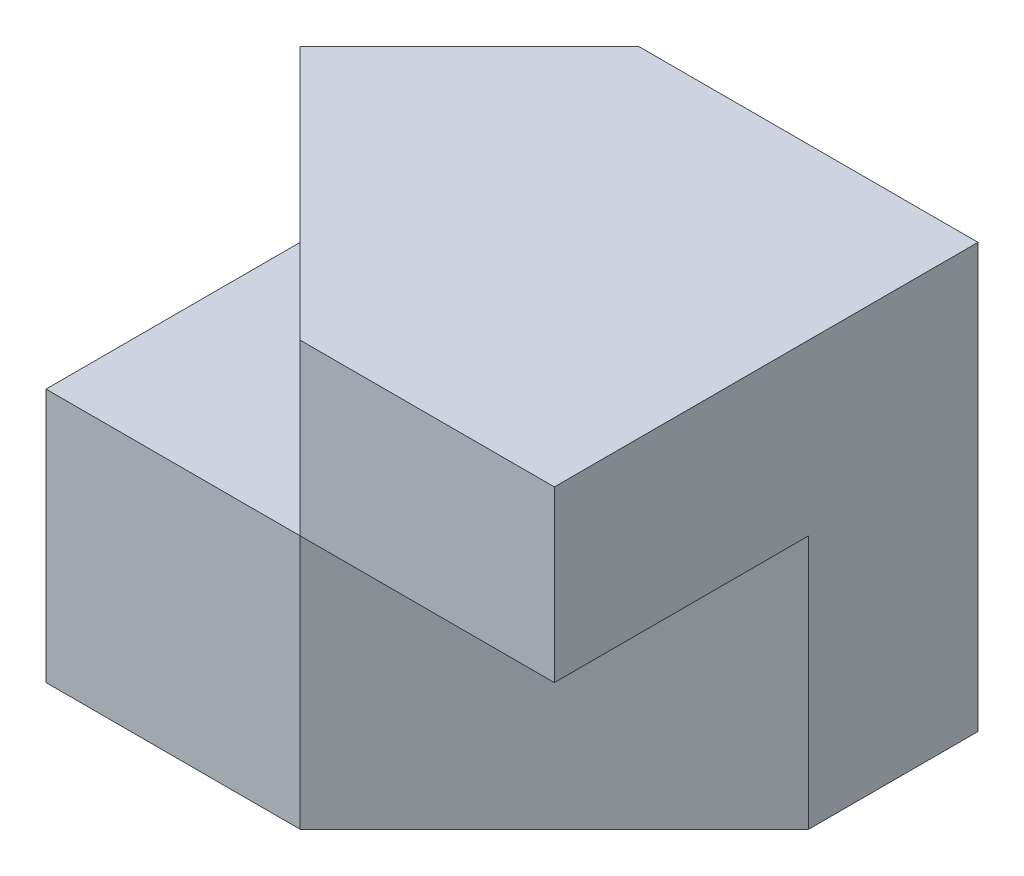
ISO-10303-21;
HEADER;
FILE_DESCRIPTION(('STEP AP214'),'2;1');
FILE_NAME('part.step','',(''),(''),'','','');
FILE_SCHEMA(('AUTOMOTIVE_DESIGN { 1 0 10303 214 1 1 1 1 }'));
ENDSEC;
DATA;
#1=APPLICATION_CONTEXT('core data for automotive mechanical design processes');
#2=APPLICATION_PROTOCOL_DEFINITION('international standard','automotive_design',2000,#1);
#3=PRODUCT_CONTEXT('',#1,'mechanical');
#4=PRODUCT('Part','Part','',(#3));
#5=PRODUCT_RELATED_PRODUCT_CATEGORY('part','',(#4));
#6=PRODUCT_DEFINITION_FORMATION('','',#4);
#7=PRODUCT_DEFINITION_CONTEXT('part definition',#1,'design');
#8=PRODUCT_DEFINITION('design','',#6,#7);
#9=PRODUCT_DEFINITION_SHAPE('','',#8);
#10=(LENGTH_UNIT() NAMED_UNIT(*) SI_UNIT(.MILLI.,.METRE.));
#11=(NAMED_UNIT(*) PLANE_ANGLE_UNIT() SI_UNIT($,.RADIAN.));
#12=(NAMED_UNIT(*) SI_UNIT($,.STERADIAN.) SOLID_ANGLE_UNIT());
#13=UNCERTAINTY_MEASURE_WITH_UNIT(LENGTH_MEASURE(1.E-05),#10,'distance_accuracy_value','');
#14=(GEOMETRIC_REPRESENTATION_CONTEXT(3) GLOBAL_UNCERTAINTY_ASSIGNED_CONTEXT((#13)) GLOBAL_UNIT_ASSIGNED_CONTEXT((#10,
#11,#12)) REPRESENTATION_CONTEXT('',''));
#15=CARTESIAN_POINT('',(0.,0.,0.));
#16=DIRECTION('',(0.,0.,1.));
#17=DIRECTION('',(1.,0.,0.));
#18=AXIS2_PLACEMENT_3D('',#15,#16,#17);
#19=CARTESIAN_POINT('',(0.,0.,5.));
#20=DIRECTION('',(0.,0.,-1.));
#21=DIRECTION('',(-1.,0.,0.));
#22=AXIS2_PLACEMENT_3D('',#19,#20,#21);
#23=PLANE('',#22);
#24=DIRECTION('',(-1.,0.,0.));
#25=VECTOR('',#24,1.);
#26=CARTESIAN_POINT('',(6.,3.,5.));
#27=LINE('',#26,#25);
#28=CARTESIAN_POINT('',(6.,3.,5.));
#29=VERTEX_POINT('',#28);
#30=CARTESIAN_POINT('',(3.,3.,5.));
#31=VERTEX_POINT('',#30);
#32=EDGE_CURVE('E97',#29,#31,#27,.T.);
#33=ORIENTED_EDGE('',*,*,#32,.F.);
#34=DIRECTION('',(0.,1.,0.));
#35=VECTOR('',#34,1.);
#36=CARTESIAN_POINT('',(6.,0.,5.));
#37=LINE('',#36,#35);
#38=CARTESIAN_POINT('',(6.,5.,5.));
#39=VERTEX_POINT('',#38);
#40=EDGE_CURVE('E158',#29,#39,#37,.T.);
#41=ORIENTED_EDGE('',*,*,#40,.T.);
#42=DIRECTION('',(-1.,0.,0.));
#43=VECTOR('',#42,1.);
#44=CARTESIAN_POINT('',(0.,5.,5.));
#45=LINE('',#44,#43);
#46=CARTESIAN_POINT('',(3.,5.,5.));
#47=VERTEX_POINT('',#46);
#48=EDGE_CURVE('E139',#39,#47,#45,.T.);
#49=ORIENTED_EDGE('',*,*,#48,.T.);
#50=DIRECTION('',(0.,1.,0.));
#51=VECTOR('',#50,1.);
#52=CARTESIAN_POINT('',(3.,3.,5.));
#53=LINE('',#52,#51);
#54=EDGE_CURVE('E133',#31,#47,#53,.T.);
#55=ORIENTED_EDGE('',*,*,#54,.F.);
#56=EDGE_LOOP('',(#33,#41,#49,#55));
#57=FACE_BOUND('',#56,.T.);
#58=ADVANCED_FACE('F33',(#57),#23,.F.);
#59=CARTESIAN_POINT('',(0.,0.,5.));
#60=DIRECTION('',(1.,0.,0.));
#61=DIRECTION('',(0.,1.,0.));
#62=AXIS2_PLACEMENT_3D('',#59,#60,#61);
#63=PLANE('',#62);
#64=DIRECTION('',(0.,0.,1.));
#65=VECTOR('',#64,1.);
#66=CARTESIAN_POINT('',(0.,3.,5.));
#67=LINE('',#66,#65);
#68=CARTESIAN_POINT('',(0.,3.,2.));
#69=VERTEX_POINT('',#68);
#70=CARTESIAN_POINT('',(0.,3.,5.));
#71=VERTEX_POINT('',#70);
#72=EDGE_CURVE('E129',#69,#71,#67,.T.);
#73=ORIENTED_EDGE('',*,*,#72,.F.);
#74=DIRECTION('',(0.,1.,0.));
#75=VECTOR('',#74,1.);
#76=CARTESIAN_POINT('',(0.,0.,2.));
#77=LINE('',#76,#75);
#78=CARTESIAN_POINT('',(0.,0.,2.));
#79=VERTEX_POINT('',#78);
#80=EDGE_CURVE('E147',#79,#69,#77,.T.);
#81=ORIENTED_EDGE('',*,*,#80,.F.);
#82=DIRECTION('',(0.,0.,-1.));
#83=VECTOR('',#82,1.);
#84=CARTESIAN_POINT('',(0.,0.,5.));
#85=LINE('',#84,#83);
#86=CARTESIAN_POINT('',(0.,0.,5.));
#87=VERTEX_POINT('',#86);
#88=EDGE_CURVE('E11',#87,#79,#85,.T.);
#89=ORIENTED_EDGE('',*,*,#88,.F.);
#90=DIRECTION('',(0.,-1.,0.));
#91=VECTOR('',#90,1.);
#92=CARTESIAN_POINT('',(0.,0.,5.));
#93=LINE('',#92,#91);
#94=EDGE_CURVE('E154',#71,#87,#93,.T.);
#95=ORIENTED_EDGE('',*,*,#94,.F.);
#96=EDGE_LOOP('',(#73,#81,#89,#95));
#97=FACE_BOUND('',#96,.T.);
#98=ADVANCED_FACE('F35',(#97),#63,.F.);
#99=CARTESIAN_POINT('',(0.,0.,5.));
#100=DIRECTION('',(0.,1.,0.));
#101=DIRECTION('',(0.,0.,1.));
#102=AXIS2_PLACEMENT_3D('',#99,#100,#101);
#103=PLANE('',#102);
#104=DIRECTION('',(0.,0.,-1.));
#105=VECTOR('',#104,1.);
#106=CARTESIAN_POINT('',(6.,0.,5.));
#107=LINE('',#106,#105);
#108=CARTESIAN_POINT('',(6.,0.,2.));
#109=VERTEX_POINT('',#108);
#110=CARTESIAN_POINT('',(6.,0.,0.));
#111=VERTEX_POINT('',#110);
#112=EDGE_CURVE('E41',#109,#111,#107,.T.);
#113=ORIENTED_EDGE('',*,*,#112,.F.);
#114=DIRECTION('',(0.707106781186548,0.,-0.707106781186548));
#115=VECTOR('',#114,1.);
#116=CARTESIAN_POINT('',(3.,0.,5.));
#117=LINE('',#116,#115);
#118=CARTESIAN_POINT('',(3.,0.,5.));
#119=VERTEX_POINT('',#118);
#120=EDGE_CURVE('E182',#119,#109,#117,.T.);
#121=ORIENTED_EDGE('',*,*,#120,.F.);
#122=DIRECTION('',(1.,0.,0.));
#123=VECTOR('',#122,1.);
#124=CARTESIAN_POINT('',(0.,0.,5.));
#125=LINE('',#124,#123);
#126=EDGE_CURVE('E121',#87,#119,#125,.T.);
#127=ORIENTED_EDGE('',*,*,#126,.F.);
#128=ORIENTED_EDGE('',*,*,#88,.T.);
#129=DIRECTION('',(0.707106781186548,0.,-0.707106781186548));
#130=VECTOR('',#129,1.);
#131=CARTESIAN_POINT('',(0.,0.,2.));
#132=LINE('',#131,#130);
#133=CARTESIAN_POINT('',(2.,0.,0.));
#134=VERTEX_POINT('',#133);
#135=EDGE_CURVE('E144',#79,#134,#132,.T.);
#136=ORIENTED_EDGE('',*,*,#135,.T.);
#137=DIRECTION('',(1.,0.,0.));
#138=VECTOR('',#137,1.);
#139=CARTESIAN_POINT('',(0.,0.,0.));
#140=LINE('',#139,#138);
#141=EDGE_CURVE('E151',#134,#111,#140,.T.);
#142=ORIENTED_EDGE('',*,*,#141,.T.);
#143=EDGE_LOOP('',(#113,#121,#127,#128,#136,#142));
#144=FACE_BOUND('',#143,.T.);
#145=ADVANCED_FACE('F176',(#144),#103,.F.);
#146=CARTESIAN_POINT('',(6.,0.,5.));
#147=DIRECTION('',(-1.,0.,0.));
#148=DIRECTION('',(0.,-1.,0.));
#149=AXIS2_PLACEMENT_3D('',#146,#147,#148);
#150=PLANE('',#149);
#151=DIRECTION('',(0.,0.,1.));
#152=VECTOR('',#151,1.);
#153=CARTESIAN_POINT('',(6.,3.,2.));
#154=LINE('',#153,#152);
#155=CARTESIAN_POINT('',(6.,3.,2.));
#156=VERTEX_POINT('',#155);
#157=EDGE_CURVE('E48',#156,#29,#154,.T.);
#158=ORIENTED_EDGE('',*,*,#157,.F.);
#159=DIRECTION('',(0.,-1.,0.));
#160=VECTOR('',#159,1.);
#161=CARTESIAN_POINT('',(6.,3.,2.));
#162=LINE('',#161,#160);
#163=EDGE_CURVE('E111',#156,#109,#162,.T.);
#164=ORIENTED_EDGE('',*,*,#163,.T.);
#165=ORIENTED_EDGE('',*,*,#112,.T.);
#166=DIRECTION('',(0.,1.,0.));
#167=VECTOR('',#166,1.);
#168=CARTESIAN_POINT('',(6.,0.,0.));
#169=LINE('',#168,#167);
#170=CARTESIAN_POINT('',(6.,5.,0.));
#171=VERTEX_POINT('',#170);
#172=EDGE_CURVE('E164',#111,#171,#169,.T.);
#173=ORIENTED_EDGE('',*,*,#172,.T.);
#174=DIRECTION('',(0.,0.,-1.));
#175=VECTOR('',#174,1.);
#176=CARTESIAN_POINT('',(6.,5.,5.));
#177=LINE('',#176,#175);
#178=EDGE_CURVE('E161',#39,#171,#177,.T.);
#179=ORIENTED_EDGE('',*,*,#178,.F.);
#180=ORIENTED_EDGE('',*,*,#40,.F.);
#181=EDGE_LOOP('',(#158,#164,#165,#173,#179,#180));
#182=FACE_BOUND('',#181,.T.);
#183=ADVANCED_FACE('F171',(#182),#150,.F.);
#184=CARTESIAN_POINT('',(0.,5.,5.));
#185=DIRECTION('',(0.,-1.,0.));
#186=DIRECTION('',(0.,0.,-1.));
#187=AXIS2_PLACEMENT_3D('',#184,#185,#186);
#188=PLANE('',#187);
#189=DIRECTION('',(0.707106781186548,0.,-0.707106781186548));
#190=VECTOR('',#189,1.);
#191=CARTESIAN_POINT('',(0.,5.,2.));
#192=LINE('',#191,#190);
#193=CARTESIAN_POINT('',(0.,5.,2.));
#194=VERTEX_POINT('',#193);
#195=CARTESIAN_POINT('',(2.,5.,0.));
#196=VERTEX_POINT('',#195);
#197=EDGE_CURVE('E56',#194,#196,#192,.T.);
#198=ORIENTED_EDGE('',*,*,#197,.F.);
#199=DIRECTION('',(-0.707106781186548,0.,-0.707106781186548));
#200=VECTOR('',#199,1.);
#201=CARTESIAN_POINT('',(0.,5.,2.));
#202=LINE('',#201,#200);
#203=EDGE_CURVE('E186',#47,#194,#202,.T.);
#204=ORIENTED_EDGE('',*,*,#203,.F.);
#205=ORIENTED_EDGE('',*,*,#48,.F.);
#206=ORIENTED_EDGE('',*,*,#178,.T.);
#207=DIRECTION('',(-1.,0.,0.));
#208=VECTOR('',#207,1.);
#209=CARTESIAN_POINT('',(0.,5.,0.));
#210=LINE('',#209,#208);
#211=EDGE_CURVE('E156',#171,#196,#210,.T.);
#212=ORIENTED_EDGE('',*,*,#211,.T.);
#213=EDGE_LOOP('',(#198,#204,#205,#206,#212));
#214=FACE_BOUND('',#213,.T.);
#215=ADVANCED_FACE('F181',(#214),#188,.F.);
#216=ORIENTED_EDGE('',*,*,#126,.T.);
#217=DIRECTION('',(0.,-1.,0.));
#218=VECTOR('',#217,1.);
#219=CARTESIAN_POINT('',(3.,3.,5.));
#220=LINE('',#219,#218);
#221=EDGE_CURVE('E108',#31,#119,#220,.T.);
#222=ORIENTED_EDGE('',*,*,#221,.F.);
#223=DIRECTION('',(1.,0.,0.));
#224=VECTOR('',#223,1.);
#225=CARTESIAN_POINT('',(3.,3.,5.));
#226=LINE('',#225,#224);
#227=EDGE_CURVE('E118',#71,#31,#226,.T.);
#228=ORIENTED_EDGE('',*,*,#227,.F.);
#229=ORIENTED_EDGE('',*,*,#94,.T.);
#230=EDGE_LOOP('',(#216,#222,#228,#229));
#231=FACE_BOUND('',#230,.T.);
#232=ADVANCED_FACE('F117',(#231),#23,.F.);
#233=CARTESIAN_POINT('',(0.,0.,0.));
#234=DIRECTION('',(0.,0.,-1.));
#235=DIRECTION('',(-1.,0.,0.));
#236=AXIS2_PLACEMENT_3D('',#233,#234,#235);
#237=PLANE('',#236);
#238=DIRECTION('',(0.,1.,0.));
#239=VECTOR('',#238,1.);
#240=CARTESIAN_POINT('',(2.,0.,0.));
#241=LINE('',#240,#239);
#242=EDGE_CURVE('E149',#134,#196,#241,.T.);
#243=ORIENTED_EDGE('',*,*,#242,.T.);
#244=ORIENTED_EDGE('',*,*,#211,.F.);
#245=ORIENTED_EDGE('',*,*,#172,.F.);
#246=ORIENTED_EDGE('',*,*,#141,.F.);
#247=EDGE_LOOP('',(#243,#244,#245,#246));
#248=FACE_BOUND('',#247,.T.);
#249=ADVANCED_FACE('F179',(#248),#237,.T.);
#250=CARTESIAN_POINT('',(0.,0.,2.));
#251=DIRECTION('',(0.707106781186548,0.,0.707106781186548));
#252=DIRECTION('',(0.707106781186548,0.,-0.707106781186548));
#253=AXIS2_PLACEMENT_3D('',#250,#251,#252);
#254=PLANE('',#253);
#255=ORIENTED_EDGE('',*,*,#197,.T.);
#256=ORIENTED_EDGE('',*,*,#242,.F.);
#257=ORIENTED_EDGE('',*,*,#135,.F.);
#258=ORIENTED_EDGE('',*,*,#80,.T.);
#259=DIRECTION('',(0.,1.,0.));
#260=VECTOR('',#259,1.);
#261=CARTESIAN_POINT('',(0.,3.,2.));
#262=LINE('',#261,#260);
#263=EDGE_CURVE('E135',#69,#194,#262,.T.);
#264=ORIENTED_EDGE('',*,*,#263,.T.);
#265=EDGE_LOOP('',(#255,#256,#257,#258,#264));
#266=FACE_BOUND('',#265,.T.);
#267=ADVANCED_FACE('F188',(#266),#254,.F.);
#268=CARTESIAN_POINT('',(0.,3.,2.));
#269=DIRECTION('',(0.707106781186547,0.,-0.707106781186547));
#270=DIRECTION('',(-0.707106781186548,0.,-0.707106781186548));
#271=AXIS2_PLACEMENT_3D('',#268,#269,#270);
#272=PLANE('',#271);
#273=ORIENTED_EDGE('',*,*,#203,.T.);
#274=ORIENTED_EDGE('',*,*,#263,.F.);
#275=DIRECTION('',(-0.707106781186548,0.,-0.707106781186548));
#276=VECTOR('',#275,1.);
#277=CARTESIAN_POINT('',(0.,3.,2.));
#278=LINE('',#277,#276);
#279=EDGE_CURVE('E127',#31,#69,#278,.T.);
#280=ORIENTED_EDGE('',*,*,#279,.F.);
#281=ORIENTED_EDGE('',*,*,#54,.T.);
#282=EDGE_LOOP('',(#273,#274,#280,#281));
#283=FACE_BOUND('',#282,.T.);
#284=ADVANCED_FACE('F132',(#283),#272,.F.);
#285=CARTESIAN_POINT('',(0.,3.,0.));
#286=DIRECTION('',(0.,1.,0.));
#287=DIRECTION('',(0.,0.,1.));
#288=AXIS2_PLACEMENT_3D('',#285,#286,#287);
#289=PLANE('',#288);
#290=ORIENTED_EDGE('',*,*,#72,.T.);
#291=ORIENTED_EDGE('',*,*,#227,.T.);
#292=ORIENTED_EDGE('',*,*,#279,.T.);
#293=EDGE_LOOP('',(#290,#291,#292));
#294=FACE_BOUND('',#293,.T.);
#295=ADVANCED_FACE('F126',(#294),#289,.T.);
#296=CARTESIAN_POINT('',(3.,3.,5.));
#297=DIRECTION('',(-0.707106781186547,0.,-0.707106781186547));
#298=DIRECTION('',(-0.707106781186548,0.,0.707106781186548));
#299=AXIS2_PLACEMENT_3D('',#296,#297,#298);
#300=PLANE('',#299);
#301=ORIENTED_EDGE('',*,*,#120,.T.);
#302=ORIENTED_EDGE('',*,*,#163,.F.);
#303=DIRECTION('',(0.707106781186548,0.,-0.707106781186548));
#304=VECTOR('',#303,1.);
#305=CARTESIAN_POINT('',(3.,3.,5.));
#306=LINE('',#305,#304);
#307=EDGE_CURVE('E100',#31,#156,#306,.T.);
#308=ORIENTED_EDGE('',*,*,#307,.F.);
#309=ORIENTED_EDGE('',*,*,#221,.T.);
#310=EDGE_LOOP('',(#301,#302,#308,#309));
#311=FACE_BOUND('',#310,.T.);
#312=ADVANCED_FACE('F107',(#311),#300,.F.);
#313=CARTESIAN_POINT('',(0.,3.,0.));
#314=DIRECTION('',(0.,-1.,0.));
#315=DIRECTION('',(0.,0.,-1.));
#316=AXIS2_PLACEMENT_3D('',#313,#314,#315);
#317=PLANE('',#316);
#318=ORIENTED_EDGE('',*,*,#157,.T.);
#319=ORIENTED_EDGE('',*,*,#32,.T.);
#320=ORIENTED_EDGE('',*,*,#307,.T.);
#321=EDGE_LOOP('',(#318,#319,#320));
#322=FACE_BOUND('',#321,.T.);
#323=ADVANCED_FACE('F99',(#322),#317,.T.);
#324=CLOSED_SHELL('',(#58,#98,#145,#183,#215,#232,#249,#267,#284,#295,#312,#323));
#325=MANIFOLD_SOLID_BREP('B2',#324);
#326=ADVANCED_BREP_SHAPE_REPRESENTATION('',(#18,#325),#14);
#327=SHAPE_DEFINITION_REPRESENTATION(#9,#326);
ENDSEC;
END-ISO-10303-21;
